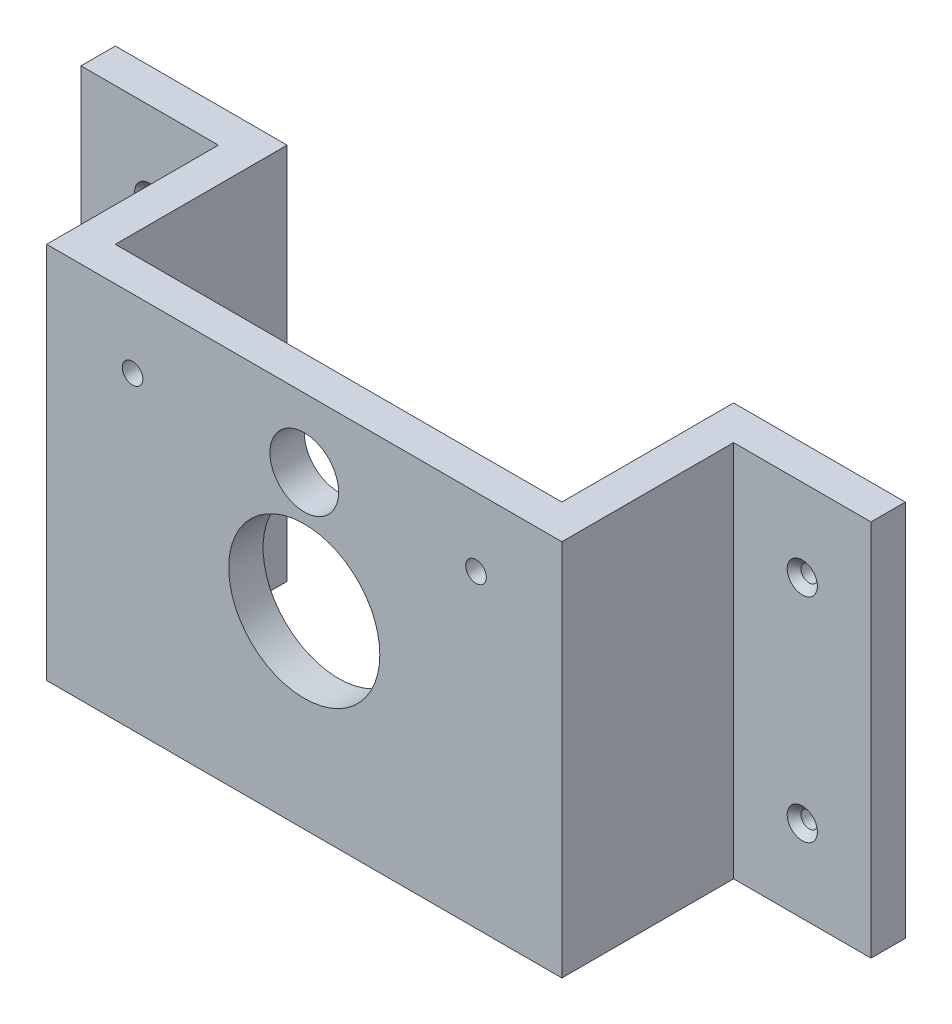
ISO-10303-21;
HEADER;
FILE_DESCRIPTION(('STEP AP214'),'2;1');
FILE_NAME('part.step','',(''),(''),'','','');
FILE_SCHEMA(('AUTOMOTIVE_DESIGN { 1 0 10303 214 1 1 1 1 }'));
ENDSEC;
DATA;
#1=APPLICATION_CONTEXT('core data for automotive mechanical design processes');
#2=APPLICATION_PROTOCOL_DEFINITION('international standard','automotive_design',2000,#1);
#3=PRODUCT_CONTEXT('',#1,'mechanical');
#4=PRODUCT('Part','Part','',(#3));
#5=PRODUCT_RELATED_PRODUCT_CATEGORY('part','',(#4));
#6=PRODUCT_DEFINITION_FORMATION('','',#4);
#7=PRODUCT_DEFINITION_CONTEXT('part definition',#1,'design');
#8=PRODUCT_DEFINITION('design','',#6,#7);
#9=PRODUCT_DEFINITION_SHAPE('','',#8);
#10=(LENGTH_UNIT() NAMED_UNIT(*) SI_UNIT(.MILLI.,.METRE.));
#11=(NAMED_UNIT(*) PLANE_ANGLE_UNIT() SI_UNIT($,.RADIAN.));
#12=(NAMED_UNIT(*) SI_UNIT($,.STERADIAN.) SOLID_ANGLE_UNIT());
#13=UNCERTAINTY_MEASURE_WITH_UNIT(LENGTH_MEASURE(1.E-05),#10,'distance_accuracy_value','');
#14=(GEOMETRIC_REPRESENTATION_CONTEXT(3) GLOBAL_UNCERTAINTY_ASSIGNED_CONTEXT((#13)) GLOBAL_UNIT_ASSIGNED_CONTEXT((#10,
#11,#12)) REPRESENTATION_CONTEXT('',''));
#15=CARTESIAN_POINT('',(0.,0.,0.));
#16=DIRECTION('',(0.,0.,1.));
#17=DIRECTION('',(1.,0.,0.));
#18=AXIS2_PLACEMENT_3D('',#15,#16,#17);
#19=CARTESIAN_POINT('',(-37.5,27.5,5.));
#20=DIRECTION('',(1.,0.,0.));
#21=DIRECTION('',(0.,1.,0.));
#22=AXIS2_PLACEMENT_3D('',#19,#20,#21);
#23=PLANE('',#22);
#24=DIRECTION('',(0.,1.,0.));
#25=VECTOR('',#24,1.);
#26=CARTESIAN_POINT('',(-37.5,27.5,-20.));
#27=LINE('',#26,#25);
#28=CARTESIAN_POINT('',(-37.5,-27.5,-20.));
#29=VERTEX_POINT('',#28);
#30=CARTESIAN_POINT('',(-37.5,27.5,-20.));
#31=VERTEX_POINT('',#30);
#32=EDGE_CURVE('E49',#29,#31,#27,.T.);
#33=ORIENTED_EDGE('',*,*,#32,.F.);
#34=DIRECTION('',(0.,0.,-1.));
#35=VECTOR('',#34,1.);
#36=CARTESIAN_POINT('',(-37.5,-27.5,5.));
#37=LINE('',#36,#35);
#38=CARTESIAN_POINT('',(-37.5,-27.5,5.));
#39=VERTEX_POINT('',#38);
#40=EDGE_CURVE('E164',#39,#29,#37,.T.);
#41=ORIENTED_EDGE('',*,*,#40,.F.);
#42=DIRECTION('',(0.,-1.,0.));
#43=VECTOR('',#42,1.);
#44=CARTESIAN_POINT('',(-37.5,27.5,5.));
#45=LINE('',#44,#43);
#46=CARTESIAN_POINT('',(-37.5,27.5,5.));
#47=VERTEX_POINT('',#46);
#48=EDGE_CURVE('E340',#47,#39,#45,.T.);
#49=ORIENTED_EDGE('',*,*,#48,.F.);
#50=DIRECTION('',(0.,0.,-1.));
#51=VECTOR('',#50,1.);
#52=CARTESIAN_POINT('',(-37.5,27.5,5.));
#53=LINE('',#52,#51);
#54=EDGE_CURVE('E41',#47,#31,#53,.T.);
#55=ORIENTED_EDGE('',*,*,#54,.T.);
#56=EDGE_LOOP('',(#33,#41,#49,#55));
#57=FACE_BOUND('',#56,.T.);
#58=ADVANCED_FACE('F32',(#57),#23,.F.);
#59=CARTESIAN_POINT('',(37.5,27.5,5.));
#60=DIRECTION('',(-1.,0.,0.));
#61=DIRECTION('',(0.,-1.,0.));
#62=AXIS2_PLACEMENT_3D('',#59,#60,#61);
#63=PLANE('',#62);
#64=DIRECTION('',(0.,-1.,0.));
#65=VECTOR('',#64,1.);
#66=CARTESIAN_POINT('',(37.5,27.5,-20.));
#67=LINE('',#66,#65);
#68=CARTESIAN_POINT('',(37.5,27.5,-20.));
#69=VERTEX_POINT('',#68);
#70=CARTESIAN_POINT('',(37.5,-27.5,-20.));
#71=VERTEX_POINT('',#70);
#72=EDGE_CURVE('E57',#69,#71,#67,.T.);
#73=ORIENTED_EDGE('',*,*,#72,.F.);
#74=DIRECTION('',(0.,0.,-1.));
#75=VECTOR('',#74,1.);
#76=CARTESIAN_POINT('',(37.5,27.5,5.));
#77=LINE('',#76,#75);
#78=CARTESIAN_POINT('',(37.5,27.5,5.));
#79=VERTEX_POINT('',#78);
#80=EDGE_CURVE('E11',#79,#69,#77,.T.);
#81=ORIENTED_EDGE('',*,*,#80,.F.);
#82=DIRECTION('',(0.,1.,0.));
#83=VECTOR('',#82,1.);
#84=CARTESIAN_POINT('',(37.5,27.5,5.));
#85=LINE('',#84,#83);
#86=CARTESIAN_POINT('',(37.5,-27.5,5.));
#87=VERTEX_POINT('',#86);
#88=EDGE_CURVE('E320',#87,#79,#85,.T.);
#89=ORIENTED_EDGE('',*,*,#88,.F.);
#90=DIRECTION('',(0.,0.,-1.));
#91=VECTOR('',#90,1.);
#92=CARTESIAN_POINT('',(37.5,-27.5,5.));
#93=LINE('',#92,#91);
#94=EDGE_CURVE('E274',#87,#71,#93,.T.);
#95=ORIENTED_EDGE('',*,*,#94,.T.);
#96=EDGE_LOOP('',(#73,#81,#89,#95));
#97=FACE_BOUND('',#96,.T.);
#98=ADVANCED_FACE('F34',(#97),#63,.F.);
#99=CARTESIAN_POINT('',(0.,0.,0.));
#100=DIRECTION('',(0.,0.,1.));
#101=DIRECTION('',(1.,0.,0.));
#102=AXIS2_PLACEMENT_3D('',#99,#100,#101);
#103=PLANE('',#102);
#104=CARTESIAN_POINT('',(0.,0.,0.));
#105=DIRECTION('',(0.,0.,1.));
#106=DIRECTION('',(1.,0.,0.));
#107=AXIS2_PLACEMENT_3D('',#104,#105,#106);
#108=CIRCLE('',#107,11.);
#109=CARTESIAN_POINT('',(11.,0.,0.));
#110=VERTEX_POINT('',#109);
#111=EDGE_CURVE('E254',#110,#110,#108,.F.);
#112=ORIENTED_EDGE('',*,*,#111,.F.);
#113=EDGE_LOOP('',(#112));
#114=FACE_BOUND('',#113,.T.);
#115=CARTESIAN_POINT('',(0.,17.5,0.));
#116=DIRECTION('',(0.,0.,1.));
#117=DIRECTION('',(1.,0.,0.));
#118=AXIS2_PLACEMENT_3D('',#115,#116,#117);
#119=CIRCLE('',#118,5.);
#120=CARTESIAN_POINT('',(5.,17.5,0.));
#121=VERTEX_POINT('',#120);
#122=EDGE_CURVE('E286',#121,#121,#119,.F.);
#123=ORIENTED_EDGE('',*,*,#122,.F.);
#124=EDGE_LOOP('',(#123));
#125=FACE_BOUND('',#124,.T.);
#126=CARTESIAN_POINT('',(25.,17.5,0.));
#127=DIRECTION('',(0.,0.,1.));
#128=DIRECTION('',(1.,0.,0.));
#129=AXIS2_PLACEMENT_3D('',#126,#127,#128);
#130=CIRCLE('',#129,1.5);
#131=CARTESIAN_POINT('',(26.5,17.5,0.));
#132=VERTEX_POINT('',#131);
#133=EDGE_CURVE('E292',#132,#132,#130,.F.);
#134=ORIENTED_EDGE('',*,*,#133,.F.);
#135=EDGE_LOOP('',(#134));
#136=FACE_BOUND('',#135,.T.);
#137=CARTESIAN_POINT('',(-25.,17.5,0.));
#138=DIRECTION('',(0.,0.,1.));
#139=DIRECTION('',(1.,0.,0.));
#140=AXIS2_PLACEMENT_3D('',#137,#138,#139);
#141=CIRCLE('',#140,1.5);
#142=CARTESIAN_POINT('',(-23.5,17.5,0.));
#143=VERTEX_POINT('',#142);
#144=EDGE_CURVE('E298',#143,#143,#141,.F.);
#145=ORIENTED_EDGE('',*,*,#144,.F.);
#146=EDGE_LOOP('',(#145));
#147=FACE_BOUND('',#146,.T.);
#148=DIRECTION('',(0.,-1.,0.));
#149=VECTOR('',#148,1.);
#150=CARTESIAN_POINT('',(-32.5,27.5,0.));
#151=LINE('',#150,#149);
#152=CARTESIAN_POINT('',(-32.5,27.5,0.));
#153=VERTEX_POINT('',#152);
#154=CARTESIAN_POINT('',(-32.5,-27.5,0.));
#155=VERTEX_POINT('',#154);
#156=EDGE_CURVE('E301',#153,#155,#151,.T.);
#157=ORIENTED_EDGE('',*,*,#156,.F.);
#158=DIRECTION('',(-1.,0.,0.));
#159=VECTOR('',#158,1.);
#160=CARTESIAN_POINT('',(-37.5,27.5,0.));
#161=LINE('',#160,#159);
#162=CARTESIAN_POINT('',(32.5,27.5,0.));
#163=VERTEX_POINT('',#162);
#164=EDGE_CURVE('E269',#163,#153,#161,.T.);
#165=ORIENTED_EDGE('',*,*,#164,.F.);
#166=DIRECTION('',(0.,1.,0.));
#167=VECTOR('',#166,1.);
#168=CARTESIAN_POINT('',(32.5,27.5,0.));
#169=LINE('',#168,#167);
#170=CARTESIAN_POINT('',(32.5,-27.5,0.));
#171=VERTEX_POINT('',#170);
#172=EDGE_CURVE('E310',#171,#163,#169,.T.);
#173=ORIENTED_EDGE('',*,*,#172,.F.);
#174=DIRECTION('',(1.,0.,0.));
#175=VECTOR('',#174,1.);
#176=CARTESIAN_POINT('',(-37.5,-27.5,0.));
#177=LINE('',#176,#175);
#178=EDGE_CURVE('E332',#155,#171,#177,.T.);
#179=ORIENTED_EDGE('',*,*,#178,.F.);
#180=EDGE_LOOP('',(#157,#165,#173,#179));
#181=FACE_BOUND('',#180,.T.);
#182=ADVANCED_FACE('F224',(#114,#125,#136,#147,#181),#103,.F.);
#183=CARTESIAN_POINT('',(-37.5,27.5,5.));
#184=DIRECTION('',(0.,-1.,0.));
#185=DIRECTION('',(0.,0.,-1.));
#186=AXIS2_PLACEMENT_3D('',#183,#184,#185);
#187=PLANE('',#186);
#188=ORIENTED_EDGE('',*,*,#80,.T.);
#189=DIRECTION('',(-1.,0.,0.));
#190=VECTOR('',#189,1.);
#191=CARTESIAN_POINT('',(57.5,27.5,-20.));
#192=LINE('',#191,#190);
#193=CARTESIAN_POINT('',(57.5,27.5,-20.));
#194=VERTEX_POINT('',#193);
#195=EDGE_CURVE('E239',#194,#69,#192,.T.);
#196=ORIENTED_EDGE('',*,*,#195,.F.);
#197=DIRECTION('',(0.,0.,1.));
#198=VECTOR('',#197,1.);
#199=CARTESIAN_POINT('',(57.5,27.5,-25.));
#200=LINE('',#199,#198);
#201=CARTESIAN_POINT('',(57.5,27.5,-25.));
#202=VERTEX_POINT('',#201);
#203=EDGE_CURVE('E370',#202,#194,#200,.T.);
#204=ORIENTED_EDGE('',*,*,#203,.F.);
#205=DIRECTION('',(1.,0.,0.));
#206=VECTOR('',#205,1.);
#207=CARTESIAN_POINT('',(37.5,27.5,-25.));
#208=LINE('',#207,#206);
#209=CARTESIAN_POINT('',(32.5,27.5,-25.));
#210=VERTEX_POINT('',#209);
#211=EDGE_CURVE('E315',#210,#202,#208,.T.);
#212=ORIENTED_EDGE('',*,*,#211,.F.);
#213=DIRECTION('',(0.,0.,1.));
#214=VECTOR('',#213,1.);
#215=CARTESIAN_POINT('',(32.5,27.5,-25.));
#216=LINE('',#215,#214);
#217=EDGE_CURVE('E317',#210,#163,#216,.T.);
#218=ORIENTED_EDGE('',*,*,#217,.T.);
#219=ORIENTED_EDGE('',*,*,#164,.T.);
#220=DIRECTION('',(0.,0.,1.));
#221=VECTOR('',#220,1.);
#222=CARTESIAN_POINT('',(-32.5,27.5,-25.));
#223=LINE('',#222,#221);
#224=CARTESIAN_POINT('',(-32.5,27.5,-25.));
#225=VERTEX_POINT('',#224);
#226=EDGE_CURVE('E308',#225,#153,#223,.T.);
#227=ORIENTED_EDGE('',*,*,#226,.F.);
#228=DIRECTION('',(1.,0.,0.));
#229=VECTOR('',#228,1.);
#230=CARTESIAN_POINT('',(-37.5,27.5,-25.));
#231=LINE('',#230,#229);
#232=CARTESIAN_POINT('',(-57.5,27.5,-25.));
#233=VERTEX_POINT('',#232);
#234=EDGE_CURVE('E302',#233,#225,#231,.T.);
#235=ORIENTED_EDGE('',*,*,#234,.F.);
#236=DIRECTION('',(0.,0.,-1.));
#237=VECTOR('',#236,1.);
#238=CARTESIAN_POINT('',(-57.5,27.5,-25.));
#239=LINE('',#238,#237);
#240=CARTESIAN_POINT('',(-57.5,27.5,-20.));
#241=VERTEX_POINT('',#240);
#242=EDGE_CURVE('E147',#241,#233,#239,.T.);
#243=ORIENTED_EDGE('',*,*,#242,.F.);
#244=DIRECTION('',(1.,0.,0.));
#245=VECTOR('',#244,1.);
#246=CARTESIAN_POINT('',(-57.5,27.5,-20.));
#247=LINE('',#246,#245);
#248=EDGE_CURVE('E157',#241,#31,#247,.T.);
#249=ORIENTED_EDGE('',*,*,#248,.T.);
#250=ORIENTED_EDGE('',*,*,#54,.F.);
#251=DIRECTION('',(-1.,0.,0.));
#252=VECTOR('',#251,1.);
#253=CARTESIAN_POINT('',(-37.5,27.5,5.));
#254=LINE('',#253,#252);
#255=EDGE_CURVE('E242',#79,#47,#254,.T.);
#256=ORIENTED_EDGE('',*,*,#255,.F.);
#257=EDGE_LOOP('',(#188,#196,#204,#212,#218,#219,#227,#235,#243,#249,#250,#256));
#258=FACE_BOUND('',#257,.T.);
#259=ADVANCED_FACE('F227',(#258),#187,.F.);
#260=CARTESIAN_POINT('',(-37.5,-27.5,5.));
#261=DIRECTION('',(0.,1.,0.));
#262=DIRECTION('',(0.,0.,1.));
#263=AXIS2_PLACEMENT_3D('',#260,#261,#262);
#264=PLANE('',#263);
#265=ORIENTED_EDGE('',*,*,#40,.T.);
#266=DIRECTION('',(1.,0.,0.));
#267=VECTOR('',#266,1.);
#268=CARTESIAN_POINT('',(-57.5,-27.5,-20.));
#269=LINE('',#268,#267);
#270=CARTESIAN_POINT('',(-57.5,-27.5,-20.));
#271=VERTEX_POINT('',#270);
#272=EDGE_CURVE('E139',#271,#29,#269,.T.);
#273=ORIENTED_EDGE('',*,*,#272,.F.);
#274=DIRECTION('',(0.,0.,1.));
#275=VECTOR('',#274,1.);
#276=CARTESIAN_POINT('',(-57.5,-27.5,-25.));
#277=LINE('',#276,#275);
#278=CARTESIAN_POINT('',(-57.5,-27.5,-25.));
#279=VERTEX_POINT('',#278);
#280=EDGE_CURVE('E136',#279,#271,#277,.T.);
#281=ORIENTED_EDGE('',*,*,#280,.F.);
#282=DIRECTION('',(-1.,0.,0.));
#283=VECTOR('',#282,1.);
#284=CARTESIAN_POINT('',(-37.5,-27.5,-25.));
#285=LINE('',#284,#283);
#286=CARTESIAN_POINT('',(-32.5,-27.5,-25.));
#287=VERTEX_POINT('',#286);
#288=EDGE_CURVE('E124',#287,#279,#285,.T.);
#289=ORIENTED_EDGE('',*,*,#288,.F.);
#290=DIRECTION('',(0.,0.,1.));
#291=VECTOR('',#290,1.);
#292=CARTESIAN_POINT('',(-32.5,-27.5,-25.));
#293=LINE('',#292,#291);
#294=EDGE_CURVE('E133',#287,#155,#293,.T.);
#295=ORIENTED_EDGE('',*,*,#294,.T.);
#296=ORIENTED_EDGE('',*,*,#178,.T.);
#297=DIRECTION('',(0.,0.,1.));
#298=VECTOR('',#297,1.);
#299=CARTESIAN_POINT('',(32.5,-27.5,-25.));
#300=LINE('',#299,#298);
#301=CARTESIAN_POINT('',(32.5,-27.5,-25.));
#302=VERTEX_POINT('',#301);
#303=EDGE_CURVE('E326',#302,#171,#300,.T.);
#304=ORIENTED_EDGE('',*,*,#303,.F.);
#305=DIRECTION('',(-1.,0.,0.));
#306=VECTOR('',#305,1.);
#307=CARTESIAN_POINT('',(37.5,-27.5,-25.));
#308=LINE('',#307,#306);
#309=CARTESIAN_POINT('',(57.5,-27.5,-25.));
#310=VERTEX_POINT('',#309);
#311=EDGE_CURVE('E311',#310,#302,#308,.T.);
#312=ORIENTED_EDGE('',*,*,#311,.F.);
#313=DIRECTION('',(0.,0.,-1.));
#314=VECTOR('',#313,1.);
#315=CARTESIAN_POINT('',(57.5,-27.5,-25.));
#316=LINE('',#315,#314);
#317=CARTESIAN_POINT('',(57.5,-27.5,-20.));
#318=VERTEX_POINT('',#317);
#319=EDGE_CURVE('E256',#318,#310,#316,.T.);
#320=ORIENTED_EDGE('',*,*,#319,.F.);
#321=DIRECTION('',(-1.,0.,0.));
#322=VECTOR('',#321,1.);
#323=CARTESIAN_POINT('',(57.5,-27.5,-20.));
#324=LINE('',#323,#322);
#325=EDGE_CURVE('E251',#318,#71,#324,.T.);
#326=ORIENTED_EDGE('',*,*,#325,.T.);
#327=ORIENTED_EDGE('',*,*,#94,.F.);
#328=DIRECTION('',(1.,0.,0.));
#329=VECTOR('',#328,1.);
#330=CARTESIAN_POINT('',(-37.5,-27.5,5.));
#331=LINE('',#330,#329);
#332=EDGE_CURVE('E338',#39,#87,#331,.T.);
#333=ORIENTED_EDGE('',*,*,#332,.F.);
#334=EDGE_LOOP('',(#265,#273,#281,#289,#295,#296,#304,#312,#320,#326,#327,#333));
#335=FACE_BOUND('',#334,.T.);
#336=ADVANCED_FACE('F137',(#335),#264,.F.);
#337=CARTESIAN_POINT('',(0.,0.,5.));
#338=DIRECTION('',(0.,0.,1.));
#339=DIRECTION('',(1.,0.,0.));
#340=AXIS2_PLACEMENT_3D('',#337,#338,#339);
#341=PLANE('',#340);
#342=CARTESIAN_POINT('',(0.,0.,5.));
#343=DIRECTION('',(0.,0.,1.));
#344=DIRECTION('',(1.,0.,0.));
#345=AXIS2_PLACEMENT_3D('',#342,#343,#344);
#346=CIRCLE('',#345,11.);
#347=CARTESIAN_POINT('',(11.,0.,5.));
#348=VERTEX_POINT('',#347);
#349=EDGE_CURVE('E250',#348,#348,#346,.T.);
#350=ORIENTED_EDGE('',*,*,#349,.F.);
#351=EDGE_LOOP('',(#350));
#352=FACE_BOUND('',#351,.T.);
#353=CARTESIAN_POINT('',(0.,17.5,5.));
#354=DIRECTION('',(0.,0.,1.));
#355=DIRECTION('',(1.,0.,0.));
#356=AXIS2_PLACEMENT_3D('',#353,#354,#355);
#357=CIRCLE('',#356,5.);
#358=CARTESIAN_POINT('',(5.,17.5,5.));
#359=VERTEX_POINT('',#358);
#360=EDGE_CURVE('E283',#359,#359,#357,.T.);
#361=ORIENTED_EDGE('',*,*,#360,.F.);
#362=EDGE_LOOP('',(#361));
#363=FACE_BOUND('',#362,.T.);
#364=CARTESIAN_POINT('',(25.,17.5,5.));
#365=DIRECTION('',(0.,0.,1.));
#366=DIRECTION('',(1.,0.,0.));
#367=AXIS2_PLACEMENT_3D('',#364,#365,#366);
#368=CIRCLE('',#367,1.5);
#369=CARTESIAN_POINT('',(26.5,17.5,5.));
#370=VERTEX_POINT('',#369);
#371=EDGE_CURVE('E289',#370,#370,#368,.T.);
#372=ORIENTED_EDGE('',*,*,#371,.F.);
#373=EDGE_LOOP('',(#372));
#374=FACE_BOUND('',#373,.T.);
#375=CARTESIAN_POINT('',(-25.,17.5,5.));
#376=DIRECTION('',(0.,0.,1.));
#377=DIRECTION('',(1.,0.,0.));
#378=AXIS2_PLACEMENT_3D('',#375,#376,#377);
#379=CIRCLE('',#378,1.5);
#380=CARTESIAN_POINT('',(-23.5,17.5,5.));
#381=VERTEX_POINT('',#380);
#382=EDGE_CURVE('E295',#381,#381,#379,.T.);
#383=ORIENTED_EDGE('',*,*,#382,.F.);
#384=EDGE_LOOP('',(#383));
#385=FACE_BOUND('',#384,.T.);
#386=ORIENTED_EDGE('',*,*,#88,.T.);
#387=ORIENTED_EDGE('',*,*,#255,.T.);
#388=ORIENTED_EDGE('',*,*,#48,.T.);
#389=ORIENTED_EDGE('',*,*,#332,.T.);
#390=EDGE_LOOP('',(#386,#387,#388,#389));
#391=FACE_BOUND('',#390,.T.);
#392=ADVANCED_FACE('F234',(#352,#363,#374,#385,#391),#341,.T.);
#393=CARTESIAN_POINT('',(32.5,27.5,-25.));
#394=DIRECTION('',(1.,0.,0.));
#395=DIRECTION('',(0.,0.,-1.));
#396=AXIS2_PLACEMENT_3D('',#393,#394,#395);
#397=PLANE('',#396);
#398=ORIENTED_EDGE('',*,*,#172,.T.);
#399=ORIENTED_EDGE('',*,*,#217,.F.);
#400=DIRECTION('',(0.,1.,0.));
#401=VECTOR('',#400,1.);
#402=CARTESIAN_POINT('',(32.5,27.5,-25.));
#403=LINE('',#402,#401);
#404=EDGE_CURVE('E313',#302,#210,#403,.T.);
#405=ORIENTED_EDGE('',*,*,#404,.F.);
#406=ORIENTED_EDGE('',*,*,#303,.T.);
#407=EDGE_LOOP('',(#398,#399,#405,#406));
#408=FACE_BOUND('',#407,.T.);
#409=ADVANCED_FACE('F360',(#408),#397,.F.);
#410=CARTESIAN_POINT('',(0.,0.,-25.));
#411=DIRECTION('',(0.,0.,-1.));
#412=DIRECTION('',(-1.,0.,0.));
#413=AXIS2_PLACEMENT_3D('',#410,#411,#412);
#414=PLANE('',#413);
#415=CARTESIAN_POINT('',(47.5,15.5,-25.));
#416=DIRECTION('',(0.,0.,-1.));
#417=DIRECTION('',(-1.,0.,0.));
#418=AXIS2_PLACEMENT_3D('',#415,#416,#417);
#419=CIRCLE('',#418,1.2);
#420=CARTESIAN_POINT('',(46.3,15.5,-25.));
#421=VERTEX_POINT('',#420);
#422=EDGE_CURVE('E176',#421,#421,#419,.T.);
#423=ORIENTED_EDGE('',*,*,#422,.F.);
#424=EDGE_LOOP('',(#423));
#425=FACE_BOUND('',#424,.T.);
#426=CARTESIAN_POINT('',(47.5,-15.5,-25.));
#427=DIRECTION('',(0.,0.,-1.));
#428=DIRECTION('',(-1.,0.,0.));
#429=AXIS2_PLACEMENT_3D('',#426,#427,#428);
#430=CIRCLE('',#429,1.2);
#431=CARTESIAN_POINT('',(46.3,-15.5,-25.));
#432=VERTEX_POINT('',#431);
#433=EDGE_CURVE('E149',#432,#432,#430,.T.);
#434=ORIENTED_EDGE('',*,*,#433,.F.);
#435=EDGE_LOOP('',(#434));
#436=FACE_BOUND('',#435,.T.);
#437=ORIENTED_EDGE('',*,*,#211,.T.);
#438=DIRECTION('',(0.,1.,0.));
#439=VECTOR('',#438,1.);
#440=CARTESIAN_POINT('',(57.5,27.5,-25.));
#441=LINE('',#440,#439);
#442=EDGE_CURVE('E160',#310,#202,#441,.T.);
#443=ORIENTED_EDGE('',*,*,#442,.F.);
#444=ORIENTED_EDGE('',*,*,#311,.T.);
#445=ORIENTED_EDGE('',*,*,#404,.T.);
#446=EDGE_LOOP('',(#437,#443,#444,#445));
#447=FACE_BOUND('',#446,.T.);
#448=ADVANCED_FACE('F363',(#425,#436,#447),#414,.T.);
#449=CARTESIAN_POINT('',(-32.5,27.5,-25.));
#450=DIRECTION('',(-1.,0.,0.));
#451=DIRECTION('',(0.,-1.,0.));
#452=AXIS2_PLACEMENT_3D('',#449,#450,#451);
#453=PLANE('',#452);
#454=ORIENTED_EDGE('',*,*,#156,.T.);
#455=ORIENTED_EDGE('',*,*,#294,.F.);
#456=DIRECTION('',(0.,-1.,0.));
#457=VECTOR('',#456,1.);
#458=CARTESIAN_POINT('',(-32.5,27.5,-25.));
#459=LINE('',#458,#457);
#460=EDGE_CURVE('E130',#225,#287,#459,.T.);
#461=ORIENTED_EDGE('',*,*,#460,.F.);
#462=ORIENTED_EDGE('',*,*,#226,.T.);
#463=EDGE_LOOP('',(#454,#455,#461,#462));
#464=FACE_BOUND('',#463,.T.);
#465=ADVANCED_FACE('F352',(#464),#453,.F.);
#466=CARTESIAN_POINT('',(0.,0.,-25.));
#467=DIRECTION('',(0.,0.,1.));
#468=DIRECTION('',(1.,0.,0.));
#469=AXIS2_PLACEMENT_3D('',#466,#467,#468);
#470=PLANE('',#469);
#471=CARTESIAN_POINT('',(-47.5,15.5,-25.));
#472=DIRECTION('',(0.,0.,1.));
#473=DIRECTION('',(1.,0.,0.));
#474=AXIS2_PLACEMENT_3D('',#471,#472,#473);
#475=CIRCLE('',#474,1.2);
#476=CARTESIAN_POINT('',(-46.3,15.5,-25.));
#477=VERTEX_POINT('',#476);
#478=EDGE_CURVE('E36',#477,#477,#475,.T.);
#479=ORIENTED_EDGE('',*,*,#478,.T.);
#480=EDGE_LOOP('',(#479));
#481=FACE_BOUND('',#480,.T.);
#482=CARTESIAN_POINT('',(-47.5,-15.5,-25.));
#483=DIRECTION('',(0.,0.,1.));
#484=DIRECTION('',(1.,0.,0.));
#485=AXIS2_PLACEMENT_3D('',#482,#483,#484);
#486=CIRCLE('',#485,1.2);
#487=CARTESIAN_POINT('',(-46.3,-15.5,-25.));
#488=VERTEX_POINT('',#487);
#489=EDGE_CURVE('E180',#488,#488,#486,.T.);
#490=ORIENTED_EDGE('',*,*,#489,.T.);
#491=EDGE_LOOP('',(#490));
#492=FACE_BOUND('',#491,.T.);
#493=ORIENTED_EDGE('',*,*,#288,.T.);
#494=DIRECTION('',(0.,-1.,0.));
#495=VECTOR('',#494,1.);
#496=CARTESIAN_POINT('',(-57.5,27.5,-25.));
#497=LINE('',#496,#495);
#498=EDGE_CURVE('E128',#233,#279,#497,.T.);
#499=ORIENTED_EDGE('',*,*,#498,.F.);
#500=ORIENTED_EDGE('',*,*,#234,.T.);
#501=ORIENTED_EDGE('',*,*,#460,.T.);
#502=EDGE_LOOP('',(#493,#499,#500,#501));
#503=FACE_BOUND('',#502,.T.);
#504=ADVANCED_FACE('F126',(#481,#492,#503),#470,.F.);
#505=CARTESIAN_POINT('',(-25.,17.5,-25.001025));
#506=DIRECTION('',(0.,0.,1.));
#507=DIRECTION('',(1.,0.,0.));
#508=AXIS2_PLACEMENT_3D('',#505,#506,#507);
#509=CYLINDRICAL_SURFACE('',#508,1.5);
#510=ORIENTED_EDGE('',*,*,#382,.T.);
#511=EDGE_LOOP('',(#510));
#512=FACE_BOUND('',#511,.T.);
#513=ORIENTED_EDGE('',*,*,#144,.T.);
#514=EDGE_LOOP('',(#513));
#515=FACE_BOUND('',#514,.T.);
#516=ADVANCED_FACE('F394',(#512,#515),#509,.F.);
#517=CARTESIAN_POINT('',(25.,17.5,-25.001025));
#518=DIRECTION('',(0.,0.,1.));
#519=DIRECTION('',(1.,0.,0.));
#520=AXIS2_PLACEMENT_3D('',#517,#518,#519);
#521=CYLINDRICAL_SURFACE('',#520,1.5);
#522=ORIENTED_EDGE('',*,*,#371,.T.);
#523=EDGE_LOOP('',(#522));
#524=FACE_BOUND('',#523,.T.);
#525=ORIENTED_EDGE('',*,*,#133,.T.);
#526=EDGE_LOOP('',(#525));
#527=FACE_BOUND('',#526,.T.);
#528=ADVANCED_FACE('F390',(#524,#527),#521,.F.);
#529=CARTESIAN_POINT('',(0.,17.5,-25.001025));
#530=DIRECTION('',(0.,0.,1.));
#531=DIRECTION('',(1.,0.,0.));
#532=AXIS2_PLACEMENT_3D('',#529,#530,#531);
#533=CYLINDRICAL_SURFACE('',#532,5.);
#534=ORIENTED_EDGE('',*,*,#360,.T.);
#535=EDGE_LOOP('',(#534));
#536=FACE_BOUND('',#535,.T.);
#537=ORIENTED_EDGE('',*,*,#122,.T.);
#538=EDGE_LOOP('',(#537));
#539=FACE_BOUND('',#538,.T.);
#540=ADVANCED_FACE('F386',(#536,#539),#533,.F.);
#541=CARTESIAN_POINT('',(0.,0.,-25.001025));
#542=DIRECTION('',(0.,0.,1.));
#543=DIRECTION('',(1.,0.,0.));
#544=AXIS2_PLACEMENT_3D('',#541,#542,#543);
#545=CYLINDRICAL_SURFACE('',#544,11.);
#546=ORIENTED_EDGE('',*,*,#349,.T.);
#547=EDGE_LOOP('',(#546));
#548=FACE_BOUND('',#547,.T.);
#549=ORIENTED_EDGE('',*,*,#111,.T.);
#550=EDGE_LOOP('',(#549));
#551=FACE_BOUND('',#550,.T.);
#552=ADVANCED_FACE('F379',(#548,#551),#545,.F.);
#553=CARTESIAN_POINT('',(57.5,27.5,-20.));
#554=DIRECTION('',(0.,0.,-1.));
#555=DIRECTION('',(0.,1.,0.));
#556=AXIS2_PLACEMENT_3D('',#553,#554,#555);
#557=PLANE('',#556);
#558=CARTESIAN_POINT('',(47.5,15.5,-20.));
#559=DIRECTION('',(0.,0.,1.));
#560=DIRECTION('',(1.,0.,0.));
#561=AXIS2_PLACEMENT_3D('',#558,#559,#560);
#562=CIRCLE('',#561,2.2);
#563=CARTESIAN_POINT('',(49.7,15.5,-20.));
#564=VERTEX_POINT('',#563);
#565=EDGE_CURVE('E182',#564,#564,#562,.T.);
#566=ORIENTED_EDGE('',*,*,#565,.F.);
#567=EDGE_LOOP('',(#566));
#568=FACE_BOUND('',#567,.T.);
#569=CARTESIAN_POINT('',(47.5,-15.5,-20.));
#570=DIRECTION('',(0.,0.,1.));
#571=DIRECTION('',(1.,0.,0.));
#572=AXIS2_PLACEMENT_3D('',#569,#570,#571);
#573=CIRCLE('',#572,2.2);
#574=CARTESIAN_POINT('',(49.7,-15.5,-20.));
#575=VERTEX_POINT('',#574);
#576=EDGE_CURVE('E178',#575,#575,#573,.T.);
#577=ORIENTED_EDGE('',*,*,#576,.F.);
#578=EDGE_LOOP('',(#577));
#579=FACE_BOUND('',#578,.T.);
#580=ORIENTED_EDGE('',*,*,#72,.T.);
#581=ORIENTED_EDGE('',*,*,#325,.F.);
#582=DIRECTION('',(0.,-1.,0.));
#583=VECTOR('',#582,1.);
#584=CARTESIAN_POINT('',(57.5,27.5,-20.));
#585=LINE('',#584,#583);
#586=EDGE_CURVE('E249',#194,#318,#585,.T.);
#587=ORIENTED_EDGE('',*,*,#586,.F.);
#588=ORIENTED_EDGE('',*,*,#195,.T.);
#589=EDGE_LOOP('',(#580,#581,#587,#588));
#590=FACE_BOUND('',#589,.T.);
#591=ADVANCED_FACE('F246',(#568,#579,#590),#557,.F.);
#592=CARTESIAN_POINT('',(57.5,0.,0.));
#593=DIRECTION('',(-1.,0.,0.));
#594=DIRECTION('',(0.,-1.,0.));
#595=AXIS2_PLACEMENT_3D('',#592,#593,#594);
#596=PLANE('',#595);
#597=ORIENTED_EDGE('',*,*,#442,.T.);
#598=ORIENTED_EDGE('',*,*,#203,.T.);
#599=ORIENTED_EDGE('',*,*,#586,.T.);
#600=ORIENTED_EDGE('',*,*,#319,.T.);
#601=EDGE_LOOP('',(#597,#598,#599,#600));
#602=FACE_BOUND('',#601,.T.);
#603=ADVANCED_FACE('F369',(#602),#596,.F.);
#604=CARTESIAN_POINT('',(-57.5,27.5,-20.));
#605=DIRECTION('',(0.,0.,-1.));
#606=DIRECTION('',(0.,1.,0.));
#607=AXIS2_PLACEMENT_3D('',#604,#605,#606);
#608=PLANE('',#607);
#609=CARTESIAN_POINT('',(-47.5,15.5,-20.));
#610=DIRECTION('',(0.,0.,1.));
#611=DIRECTION('',(1.,0.,0.));
#612=AXIS2_PLACEMENT_3D('',#609,#610,#611);
#613=CIRCLE('',#612,2.2);
#614=CARTESIAN_POINT('',(-45.3,15.5,-20.));
#615=VERTEX_POINT('',#614);
#616=EDGE_CURVE('E555',#615,#615,#613,.T.);
#617=ORIENTED_EDGE('',*,*,#616,.F.);
#618=EDGE_LOOP('',(#617));
#619=FACE_BOUND('',#618,.T.);
#620=CARTESIAN_POINT('',(-47.5,-15.5,-20.));
#621=DIRECTION('',(0.,0.,1.));
#622=DIRECTION('',(1.,0.,0.));
#623=AXIS2_PLACEMENT_3D('',#620,#621,#622);
#624=CIRCLE('',#623,2.2);
#625=CARTESIAN_POINT('',(-45.3,-15.5,-20.));
#626=VERTEX_POINT('',#625);
#627=EDGE_CURVE('E189',#626,#626,#624,.T.);
#628=ORIENTED_EDGE('',*,*,#627,.F.);
#629=EDGE_LOOP('',(#628));
#630=FACE_BOUND('',#629,.T.);
#631=ORIENTED_EDGE('',*,*,#32,.T.);
#632=ORIENTED_EDGE('',*,*,#248,.F.);
#633=DIRECTION('',(0.,1.,0.));
#634=VECTOR('',#633,1.);
#635=CARTESIAN_POINT('',(-57.5,27.5,-20.));
#636=LINE('',#635,#634);
#637=EDGE_CURVE('E142',#271,#241,#636,.T.);
#638=ORIENTED_EDGE('',*,*,#637,.F.);
#639=ORIENTED_EDGE('',*,*,#272,.T.);
#640=EDGE_LOOP('',(#631,#632,#638,#639));
#641=FACE_BOUND('',#640,.T.);
#642=ADVANCED_FACE('F346',(#619,#630,#641),#608,.F.);
#643=CARTESIAN_POINT('',(-57.5,0.,0.));
#644=DIRECTION('',(-1.,0.,0.));
#645=DIRECTION('',(0.,-1.,0.));
#646=AXIS2_PLACEMENT_3D('',#643,#644,#645);
#647=PLANE('',#646);
#648=ORIENTED_EDGE('',*,*,#498,.T.);
#649=ORIENTED_EDGE('',*,*,#280,.T.);
#650=ORIENTED_EDGE('',*,*,#637,.T.);
#651=ORIENTED_EDGE('',*,*,#242,.T.);
#652=EDGE_LOOP('',(#648,#649,#650,#651));
#653=FACE_BOUND('',#652,.T.);
#654=ADVANCED_FACE('F145',(#653),#647,.T.);
#655=CARTESIAN_POINT('',(47.5,-15.5,-20.));
#656=DIRECTION('',(0.,0.,1.));
#657=DIRECTION('',(1.,0.,0.));
#658=AXIS2_PLACEMENT_3D('',#655,#656,#657);
#659=CYLINDRICAL_SURFACE('',#658,1.2);
#660=ORIENTED_EDGE('',*,*,#433,.T.);
#661=EDGE_LOOP('',(#660));
#662=FACE_BOUND('',#661,.T.);
#663=CARTESIAN_POINT('',(47.5,-15.5,-21.));
#664=DIRECTION('',(0.,0.,1.));
#665=DIRECTION('',(1.,0.,0.));
#666=AXIS2_PLACEMENT_3D('',#663,#664,#665);
#667=CIRCLE('',#666,1.2);
#668=CARTESIAN_POINT('',(48.7,-15.5,-21.));
#669=VERTEX_POINT('',#668);
#670=EDGE_CURVE('E152',#669,#669,#667,.T.);
#671=ORIENTED_EDGE('',*,*,#670,.T.);
#672=EDGE_LOOP('',(#671));
#673=FACE_BOUND('',#672,.T.);
#674=ADVANCED_FACE('F204',(#662,#673),#659,.F.);
#675=CARTESIAN_POINT('',(47.5,-15.5,-20.));
#676=DIRECTION('',(0.,0.,1.));
#677=DIRECTION('',(1.,0.,0.));
#678=AXIS2_PLACEMENT_3D('',#675,#676,#677);
#679=CONICAL_SURFACE('',#678,2.2,0.785398163397448);
#680=ORIENTED_EDGE('',*,*,#670,.F.);
#681=EDGE_LOOP('',(#680));
#682=FACE_BOUND('',#681,.T.);
#683=ORIENTED_EDGE('',*,*,#576,.T.);
#684=EDGE_LOOP('',(#683));
#685=FACE_BOUND('',#684,.T.);
#686=ADVANCED_FACE('F206',(#682,#685),#679,.F.);
#687=CARTESIAN_POINT('',(47.5,15.5,-20.));
#688=DIRECTION('',(0.,0.,1.));
#689=DIRECTION('',(1.,0.,0.));
#690=AXIS2_PLACEMENT_3D('',#687,#688,#689);
#691=CYLINDRICAL_SURFACE('',#690,1.2);
#692=ORIENTED_EDGE('',*,*,#422,.T.);
#693=EDGE_LOOP('',(#692));
#694=FACE_BOUND('',#693,.T.);
#695=CARTESIAN_POINT('',(47.5,15.5,-21.));
#696=DIRECTION('',(0.,0.,1.));
#697=DIRECTION('',(1.,0.,0.));
#698=AXIS2_PLACEMENT_3D('',#695,#696,#697);
#699=CIRCLE('',#698,1.2);
#700=CARTESIAN_POINT('',(48.7,15.5,-21.));
#701=VERTEX_POINT('',#700);
#702=EDGE_CURVE('E179',#701,#701,#699,.T.);
#703=ORIENTED_EDGE('',*,*,#702,.T.);
#704=EDGE_LOOP('',(#703));
#705=FACE_BOUND('',#704,.T.);
#706=ADVANCED_FACE('F208',(#694,#705),#691,.F.);
#707=CARTESIAN_POINT('',(47.5,15.5,-20.));
#708=DIRECTION('',(0.,0.,1.));
#709=DIRECTION('',(1.,0.,0.));
#710=AXIS2_PLACEMENT_3D('',#707,#708,#709);
#711=CONICAL_SURFACE('',#710,2.2,0.785398163397448);
#712=ORIENTED_EDGE('',*,*,#702,.F.);
#713=EDGE_LOOP('',(#712));
#714=FACE_BOUND('',#713,.T.);
#715=ORIENTED_EDGE('',*,*,#565,.T.);
#716=EDGE_LOOP('',(#715));
#717=FACE_BOUND('',#716,.T.);
#718=ADVANCED_FACE('F214',(#714,#717),#711,.F.);
#719=CARTESIAN_POINT('',(-47.5,-15.5,-20.));
#720=DIRECTION('',(0.,0.,1.));
#721=DIRECTION('',(1.,0.,0.));
#722=AXIS2_PLACEMENT_3D('',#719,#720,#721);
#723=CYLINDRICAL_SURFACE('',#722,1.2);
#724=CARTESIAN_POINT('',(-47.5,-15.5,-21.));
#725=DIRECTION('',(0.,0.,1.));
#726=DIRECTION('',(1.,0.,0.));
#727=AXIS2_PLACEMENT_3D('',#724,#725,#726);
#728=CIRCLE('',#727,1.2);
#729=CARTESIAN_POINT('',(-46.3,-15.5,-21.));
#730=VERTEX_POINT('',#729);
#731=EDGE_CURVE('E183',#730,#730,#728,.T.);
#732=ORIENTED_EDGE('',*,*,#731,.T.);
#733=EDGE_LOOP('',(#732));
#734=FACE_BOUND('',#733,.T.);
#735=ORIENTED_EDGE('',*,*,#489,.F.);
#736=EDGE_LOOP('',(#735));
#737=FACE_BOUND('',#736,.T.);
#738=ADVANCED_FACE('F506',(#734,#737),#723,.F.);
#739=CARTESIAN_POINT('',(-47.5,-15.5,-20.));
#740=DIRECTION('',(0.,0.,1.));
#741=DIRECTION('',(1.,0.,0.));
#742=AXIS2_PLACEMENT_3D('',#739,#740,#741);
#743=CONICAL_SURFACE('',#742,2.2,0.785398163397448);
#744=ORIENTED_EDGE('',*,*,#731,.F.);
#745=EDGE_LOOP('',(#744));
#746=FACE_BOUND('',#745,.T.);
#747=ORIENTED_EDGE('',*,*,#627,.T.);
#748=EDGE_LOOP('',(#747));
#749=FACE_BOUND('',#748,.T.);
#750=ADVANCED_FACE('F516',(#746,#749),#743,.F.);
#751=CARTESIAN_POINT('',(-47.5,15.5,-20.));
#752=DIRECTION('',(0.,0.,1.));
#753=DIRECTION('',(1.,0.,0.));
#754=AXIS2_PLACEMENT_3D('',#751,#752,#753);
#755=CYLINDRICAL_SURFACE('',#754,1.2);
#756=CARTESIAN_POINT('',(-47.5,15.5,-21.));
#757=DIRECTION('',(0.,0.,1.));
#758=DIRECTION('',(1.,0.,0.));
#759=AXIS2_PLACEMENT_3D('',#756,#757,#758);
#760=CIRCLE('',#759,1.2);
#761=CARTESIAN_POINT('',(-46.3,15.5,-21.));
#762=VERTEX_POINT('',#761);
#763=EDGE_CURVE('E552',#762,#762,#760,.T.);
#764=ORIENTED_EDGE('',*,*,#763,.T.);
#765=EDGE_LOOP('',(#764));
#766=FACE_BOUND('',#765,.T.);
#767=ORIENTED_EDGE('',*,*,#478,.F.);
#768=EDGE_LOOP('',(#767));
#769=FACE_BOUND('',#768,.T.);
#770=ADVANCED_FACE('F525',(#766,#769),#755,.F.);
#771=CARTESIAN_POINT('',(-47.5,15.5,-20.));
#772=DIRECTION('',(0.,0.,1.));
#773=DIRECTION('',(1.,0.,0.));
#774=AXIS2_PLACEMENT_3D('',#771,#772,#773);
#775=CONICAL_SURFACE('',#774,2.2,0.785398163397448);
#776=ORIENTED_EDGE('',*,*,#763,.F.);
#777=EDGE_LOOP('',(#776));
#778=FACE_BOUND('',#777,.T.);
#779=ORIENTED_EDGE('',*,*,#616,.T.);
#780=EDGE_LOOP('',(#779));
#781=FACE_BOUND('',#780,.T.);
#782=ADVANCED_FACE('F535',(#778,#781),#775,.F.);
#783=CLOSED_SHELL('',(#58,#98,#182,#259,#336,#392,#409,#448,#465,#504,#516,#528,#540,#552,#591,
#603,#642,#654,#674,#686,#706,#718,#738,#750,#770,#782));
#784=MANIFOLD_SOLID_BREP('B2',#783);
#785=ADVANCED_BREP_SHAPE_REPRESENTATION('',(#18,#784),#14);
#786=SHAPE_DEFINITION_REPRESENTATION(#9,#785);
ENDSEC;
END-ISO-10303-21;
